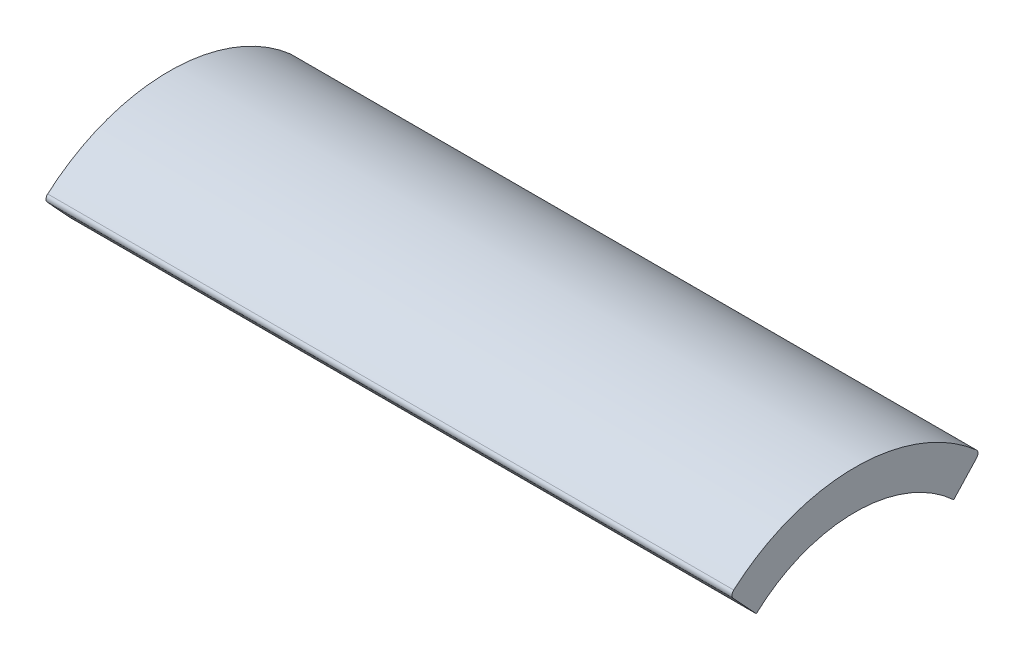
ISO-10303-21;
HEADER;
FILE_DESCRIPTION(('STEP AP214'),'2;1');
FILE_NAME('part.step','',(''),(''),'','','');
FILE_SCHEMA(('AUTOMOTIVE_DESIGN { 1 0 10303 214 1 1 1 1 }'));
ENDSEC;
DATA;
#1=APPLICATION_CONTEXT('core data for automotive mechanical design processes');
#2=APPLICATION_PROTOCOL_DEFINITION('international standard','automotive_design',2000,#1);
#3=PRODUCT_CONTEXT('',#1,'mechanical');
#4=PRODUCT('Part','Part','',(#3));
#5=PRODUCT_RELATED_PRODUCT_CATEGORY('part','',(#4));
#6=PRODUCT_DEFINITION_FORMATION('','',#4);
#7=PRODUCT_DEFINITION_CONTEXT('part definition',#1,'design');
#8=PRODUCT_DEFINITION('design','',#6,#7);
#9=PRODUCT_DEFINITION_SHAPE('','',#8);
#10=(LENGTH_UNIT() NAMED_UNIT(*) SI_UNIT(.MILLI.,.METRE.));
#11=(NAMED_UNIT(*) PLANE_ANGLE_UNIT() SI_UNIT($,.RADIAN.));
#12=(NAMED_UNIT(*) SI_UNIT($,.STERADIAN.) SOLID_ANGLE_UNIT());
#13=UNCERTAINTY_MEASURE_WITH_UNIT(LENGTH_MEASURE(1.E-05),#10,'distance_accuracy_value','');
#14=(GEOMETRIC_REPRESENTATION_CONTEXT(3) GLOBAL_UNCERTAINTY_ASSIGNED_CONTEXT((#13)) GLOBAL_UNIT_ASSIGNED_CONTEXT((#10,
#11,#12)) REPRESENTATION_CONTEXT('',''));
#15=CARTESIAN_POINT('',(0.,0.,0.));
#16=DIRECTION('',(0.,0.,1.));
#17=DIRECTION('',(1.,0.,0.));
#18=AXIS2_PLACEMENT_3D('',#15,#16,#17);
#19=CARTESIAN_POINT('',(17.5,6.88624274742576,6.02512745288647));
#20=DIRECTION('',(-1.,0.,0.));
#21=DIRECTION('',(0.,0.,1.));
#22=AXIS2_PLACEMENT_3D('',#19,#20,#21);
#23=CYLINDRICAL_SURFACE('',#22,0.249999999999999);
#24=CARTESIAN_POINT('',(-17.5,6.88624274742576,6.02512745288647));
#25=DIRECTION('',(1.,0.,0.));
#26=DIRECTION('',(0.,0.,-1.));
#27=AXIS2_PLACEMENT_3D('',#24,#25,#26);
#28=CIRCLE('',#27,0.249999999999999);
#29=CARTESIAN_POINT('',(-17.5,7.07439145637181,6.18974842154457));
#30=VERTEX_POINT('',#29);
#31=CARTESIAN_POINT('',(-17.5,6.71654256104252,6.20870808024539));
#32=VERTEX_POINT('',#31);
#33=EDGE_CURVE('E122',#30,#32,#28,.T.);
#34=ORIENTED_EDGE('',*,*,#33,.T.);
#35=DIRECTION('',(-1.,0.,0.));
#36=VECTOR('',#35,1.);
#37=CARTESIAN_POINT('',(17.5,6.71654256104252,6.20870808024539));
#38=LINE('',#37,#36);
#39=CARTESIAN_POINT('',(17.5,6.71654256104252,6.20870808024539));
#40=VERTEX_POINT('',#39);
#41=EDGE_CURVE('E11',#40,#32,#38,.T.);
#42=ORIENTED_EDGE('',*,*,#41,.F.);
#43=CARTESIAN_POINT('',(17.5,6.88624274742576,6.02512745288647));
#44=DIRECTION('',(1.,0.,0.));
#45=DIRECTION('',(0.,0.,-1.));
#46=AXIS2_PLACEMENT_3D('',#43,#44,#45);
#47=CIRCLE('',#46,0.249999999999999);
#48=CARTESIAN_POINT('',(17.5,7.07439145637181,6.18974842154457));
#49=VERTEX_POINT('',#48);
#50=EDGE_CURVE('E135',#49,#40,#47,.T.);
#51=ORIENTED_EDGE('',*,*,#50,.F.);
#52=DIRECTION('',(-1.,0.,0.));
#53=VECTOR('',#52,1.);
#54=CARTESIAN_POINT('',(17.5,7.07439145637181,6.18974842154457));
#55=LINE('',#54,#53);
#56=EDGE_CURVE('E53',#49,#30,#55,.T.);
#57=ORIENTED_EDGE('',*,*,#56,.T.);
#58=EDGE_LOOP('',(#34,#42,#51,#57));
#59=FACE_BOUND('',#58,.T.);
#60=ADVANCED_FACE('F37',(#59),#23,.T.);
#61=CARTESIAN_POINT('',(17.5,6.71654256104252,6.20870808024539));
#62=DIRECTION('',(0.,0.678800745532943,-0.734322509435684));
#63=DIRECTION('',(0.,0.734322509435684,0.678800745532943));
#64=AXIS2_PLACEMENT_3D('',#61,#62,#63);
#65=PLANE('',#64);
#66=DIRECTION('',(0.,-0.734322509435684,-0.678800745532943));
#67=VECTOR('',#66,1.);
#68=CARTESIAN_POINT('',(-17.5,6.71654256104252,6.20870808024539));
#69=LINE('',#68,#67);
#70=CARTESIAN_POINT('',(-17.5,5.44867302001278,5.03670153185444));
#71=VERTEX_POINT('',#70);
#72=EDGE_CURVE('E124',#32,#71,#69,.T.);
#73=ORIENTED_EDGE('',*,*,#72,.T.);
#74=DIRECTION('',(-1.,0.,0.));
#75=VECTOR('',#74,1.);
#76=CARTESIAN_POINT('',(17.5,5.44867302001278,5.03670153185444));
#77=LINE('',#76,#75);
#78=CARTESIAN_POINT('',(17.5,5.44867302001278,5.03670153185444));
#79=VERTEX_POINT('',#78);
#80=EDGE_CURVE('E45',#79,#71,#77,.T.);
#81=ORIENTED_EDGE('',*,*,#80,.F.);
#82=DIRECTION('',(0.,-0.734322509435684,-0.678800745532943));
#83=VECTOR('',#82,1.);
#84=CARTESIAN_POINT('',(17.5,6.71654256104252,6.20870808024539));
#85=LINE('',#84,#83);
#86=EDGE_CURVE('E86',#40,#79,#85,.T.);
#87=ORIENTED_EDGE('',*,*,#86,.F.);
#88=ORIENTED_EDGE('',*,*,#41,.T.);
#89=EDGE_LOOP('',(#73,#81,#87,#88));
#90=FACE_BOUND('',#89,.T.);
#91=ADVANCED_FACE('F155',(#90),#65,.F.);
#92=CARTESIAN_POINT('',(17.5,0.,0.));
#93=DIRECTION('',(-1.,0.,0.));
#94=DIRECTION('',(0.,0.,1.));
#95=AXIS2_PLACEMENT_3D('',#92,#93,#94);
#96=CYLINDRICAL_SURFACE('',#95,7.42);
#97=CARTESIAN_POINT('',(-17.5,0.,0.));
#98=DIRECTION('',(-1.,0.,0.));
#99=DIRECTION('',(0.,0.,1.));
#100=AXIS2_PLACEMENT_3D('',#97,#98,#99);
#101=CIRCLE('',#100,7.42);
#102=CARTESIAN_POINT('',(-17.5,5.44867302001278,-5.03670153185444));
#103=VERTEX_POINT('',#102);
#104=EDGE_CURVE('E126',#71,#103,#101,.T.);
#105=ORIENTED_EDGE('',*,*,#104,.T.);
#106=DIRECTION('',(-1.,0.,0.));
#107=VECTOR('',#106,1.);
#108=CARTESIAN_POINT('',(17.5,5.44867302001278,-5.03670153185444));
#109=LINE('',#108,#107);
#110=CARTESIAN_POINT('',(17.5,5.44867302001278,-5.03670153185444));
#111=VERTEX_POINT('',#110);
#112=EDGE_CURVE('E105',#111,#103,#109,.T.);
#113=ORIENTED_EDGE('',*,*,#112,.F.);
#114=CARTESIAN_POINT('',(17.5,0.,0.));
#115=DIRECTION('',(-1.,0.,0.));
#116=DIRECTION('',(0.,0.,1.));
#117=AXIS2_PLACEMENT_3D('',#114,#115,#116);
#118=CIRCLE('',#117,7.42);
#119=EDGE_CURVE('E115',#79,#111,#118,.T.);
#120=ORIENTED_EDGE('',*,*,#119,.F.);
#121=ORIENTED_EDGE('',*,*,#80,.T.);
#122=EDGE_LOOP('',(#105,#113,#120,#121));
#123=FACE_BOUND('',#122,.T.);
#124=ADVANCED_FACE('F141',(#123),#96,.F.);
#125=CARTESIAN_POINT('',(17.5,6.71654256104252,-6.20870808024539));
#126=DIRECTION('',(0.,-0.678800745532943,-0.734322509435684));
#127=DIRECTION('',(0.,0.734322509435684,-0.678800745532943));
#128=AXIS2_PLACEMENT_3D('',#125,#126,#127);
#129=PLANE('',#128);
#130=DIRECTION('',(0.,-0.734322509435684,0.678800745532943));
#131=VECTOR('',#130,1.);
#132=CARTESIAN_POINT('',(-17.5,6.71654256104252,-6.20870808024539));
#133=LINE('',#132,#131);
#134=CARTESIAN_POINT('',(-17.5,6.71654256104252,-6.20870808024539));
#135=VERTEX_POINT('',#134);
#136=EDGE_CURVE('E102',#135,#103,#133,.T.);
#137=ORIENTED_EDGE('',*,*,#136,.F.);
#138=DIRECTION('',(-1.,0.,0.));
#139=VECTOR('',#138,1.);
#140=CARTESIAN_POINT('',(17.5,6.71654256104252,-6.20870808024539));
#141=LINE('',#140,#139);
#142=CARTESIAN_POINT('',(17.5,6.71654256104252,-6.20870808024539));
#143=VERTEX_POINT('',#142);
#144=EDGE_CURVE('E96',#143,#135,#141,.T.);
#145=ORIENTED_EDGE('',*,*,#144,.F.);
#146=DIRECTION('',(0.,-0.734322509435684,0.678800745532943));
#147=VECTOR('',#146,1.);
#148=CARTESIAN_POINT('',(17.5,6.71654256104252,-6.20870808024539));
#149=LINE('',#148,#147);
#150=EDGE_CURVE('E100',#143,#111,#149,.T.);
#151=ORIENTED_EDGE('',*,*,#150,.T.);
#152=ORIENTED_EDGE('',*,*,#112,.T.);
#153=EDGE_LOOP('',(#137,#145,#151,#152));
#154=FACE_BOUND('',#153,.T.);
#155=ADVANCED_FACE('F98',(#154),#129,.T.);
#156=CARTESIAN_POINT('',(17.5,6.88624274742576,-6.02512745288647));
#157=DIRECTION('',(-1.,0.,0.));
#158=DIRECTION('',(0.,0.,1.));
#159=AXIS2_PLACEMENT_3D('',#156,#157,#158);
#160=CYLINDRICAL_SURFACE('',#159,0.249999999999999);
#161=CARTESIAN_POINT('',(-17.5,6.88624274742576,-6.02512745288647));
#162=DIRECTION('',(1.,0.,0.));
#163=DIRECTION('',(0.,0.,-1.));
#164=AXIS2_PLACEMENT_3D('',#161,#162,#163);
#165=CIRCLE('',#164,0.249999999999999);
#166=CARTESIAN_POINT('',(-17.5,7.07439145637181,-6.18974842154457));
#167=VERTEX_POINT('',#166);
#168=EDGE_CURVE('E130',#135,#167,#165,.T.);
#169=ORIENTED_EDGE('',*,*,#168,.T.);
#170=DIRECTION('',(-1.,0.,0.));
#171=VECTOR('',#170,1.);
#172=CARTESIAN_POINT('',(17.5,7.07439145637181,-6.18974842154457));
#173=LINE('',#172,#171);
#174=CARTESIAN_POINT('',(17.5,7.07439145637181,-6.18974842154457));
#175=VERTEX_POINT('',#174);
#176=EDGE_CURVE('E74',#175,#167,#173,.T.);
#177=ORIENTED_EDGE('',*,*,#176,.F.);
#178=CARTESIAN_POINT('',(17.5,6.88624274742576,-6.02512745288647));
#179=DIRECTION('',(1.,0.,0.));
#180=DIRECTION('',(0.,0.,-1.));
#181=AXIS2_PLACEMENT_3D('',#178,#179,#180);
#182=CIRCLE('',#181,0.249999999999999);
#183=EDGE_CURVE('E107',#143,#175,#182,.T.);
#184=ORIENTED_EDGE('',*,*,#183,.F.);
#185=ORIENTED_EDGE('',*,*,#144,.T.);
#186=EDGE_LOOP('',(#169,#177,#184,#185));
#187=FACE_BOUND('',#186,.T.);
#188=ADVANCED_FACE('F108',(#187),#160,.T.);
#189=CARTESIAN_POINT('',(17.5,0.,0.));
#190=DIRECTION('',(-1.,0.,0.));
#191=DIRECTION('',(0.,0.,1.));
#192=AXIS2_PLACEMENT_3D('',#189,#190,#191);
#193=CYLINDRICAL_SURFACE('',#192,9.4);
#194=CARTESIAN_POINT('',(-17.5,0.,0.));
#195=DIRECTION('',(-1.,0.,0.));
#196=DIRECTION('',(0.,0.,1.));
#197=AXIS2_PLACEMENT_3D('',#194,#195,#196);
#198=CIRCLE('',#197,9.4);
#199=EDGE_CURVE('E132',#30,#167,#198,.T.);
#200=ORIENTED_EDGE('',*,*,#199,.F.);
#201=ORIENTED_EDGE('',*,*,#56,.F.);
#202=CARTESIAN_POINT('',(17.5,0.,0.));
#203=DIRECTION('',(-1.,0.,0.));
#204=DIRECTION('',(0.,0.,1.));
#205=AXIS2_PLACEMENT_3D('',#202,#203,#204);
#206=CIRCLE('',#205,9.4);
#207=EDGE_CURVE('E111',#49,#175,#206,.T.);
#208=ORIENTED_EDGE('',*,*,#207,.T.);
#209=ORIENTED_EDGE('',*,*,#176,.T.);
#210=EDGE_LOOP('',(#200,#201,#208,#209));
#211=FACE_BOUND('',#210,.T.);
#212=ADVANCED_FACE('F144',(#211),#193,.T.);
#213=CARTESIAN_POINT('',(17.5,6.88624274742576,6.02512745288647));
#214=DIRECTION('',(1.,0.,0.));
#215=DIRECTION('',(0.,0.,-1.));
#216=AXIS2_PLACEMENT_3D('',#213,#214,#215);
#217=PLANE('',#216);
#218=ORIENTED_EDGE('',*,*,#50,.T.);
#219=ORIENTED_EDGE('',*,*,#86,.T.);
#220=ORIENTED_EDGE('',*,*,#119,.T.);
#221=ORIENTED_EDGE('',*,*,#150,.F.);
#222=ORIENTED_EDGE('',*,*,#183,.T.);
#223=ORIENTED_EDGE('',*,*,#207,.F.);
#224=EDGE_LOOP('',(#218,#219,#220,#221,#222,#223));
#225=FACE_BOUND('',#224,.T.);
#226=ADVANCED_FACE('F113',(#225),#217,.T.);
#227=CARTESIAN_POINT('',(-17.5,6.88624274742576,6.02512745288647));
#228=DIRECTION('',(1.,0.,0.));
#229=DIRECTION('',(0.,0.,-1.));
#230=AXIS2_PLACEMENT_3D('',#227,#228,#229);
#231=PLANE('',#230);
#232=ORIENTED_EDGE('',*,*,#33,.F.);
#233=ORIENTED_EDGE('',*,*,#199,.T.);
#234=ORIENTED_EDGE('',*,*,#168,.F.);
#235=ORIENTED_EDGE('',*,*,#136,.T.);
#236=ORIENTED_EDGE('',*,*,#104,.F.);
#237=ORIENTED_EDGE('',*,*,#72,.F.);
#238=EDGE_LOOP('',(#232,#233,#234,#235,#236,#237));
#239=FACE_BOUND('',#238,.T.);
#240=ADVANCED_FACE('F143',(#239),#231,.F.);
#241=CLOSED_SHELL('',(#60,#91,#124,#155,#188,#212,#226,#240));
#242=MANIFOLD_SOLID_BREP('B2',#241);
#243=ADVANCED_BREP_SHAPE_REPRESENTATION('',(#18,#242),#14);
#244=SHAPE_DEFINITION_REPRESENTATION(#9,#243);
ENDSEC;
END-ISO-10303-21;
